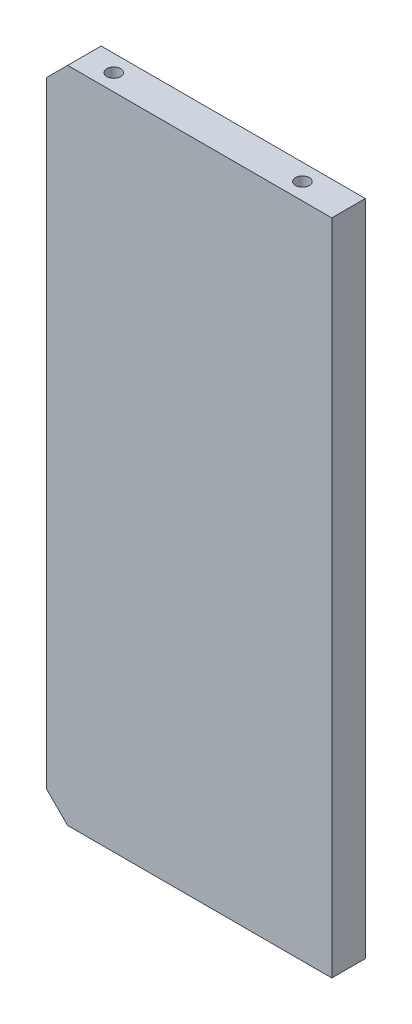
ISO-10303-21;
HEADER;
FILE_DESCRIPTION(('STEP AP214'),'2;1');
FILE_NAME('part.step','',(''),(''),'','','');
FILE_SCHEMA(('AUTOMOTIVE_DESIGN { 1 0 10303 214 1 1 1 1 }'));
ENDSEC;
DATA;
#1=APPLICATION_CONTEXT('core data for automotive mechanical design processes');
#2=APPLICATION_PROTOCOL_DEFINITION('international standard','automotive_design',2000,#1);
#3=PRODUCT_CONTEXT('',#1,'mechanical');
#4=PRODUCT('Part','Part','',(#3));
#5=PRODUCT_RELATED_PRODUCT_CATEGORY('part','',(#4));
#6=PRODUCT_DEFINITION_FORMATION('','',#4);
#7=PRODUCT_DEFINITION_CONTEXT('part definition',#1,'design');
#8=PRODUCT_DEFINITION('design','',#6,#7);
#9=PRODUCT_DEFINITION_SHAPE('','',#8);
#10=(LENGTH_UNIT() NAMED_UNIT(*) SI_UNIT(.MILLI.,.METRE.));
#11=(NAMED_UNIT(*) PLANE_ANGLE_UNIT() SI_UNIT($,.RADIAN.));
#12=(NAMED_UNIT(*) SI_UNIT($,.STERADIAN.) SOLID_ANGLE_UNIT());
#13=UNCERTAINTY_MEASURE_WITH_UNIT(LENGTH_MEASURE(1.E-05),#10,'distance_accuracy_value','');
#14=(GEOMETRIC_REPRESENTATION_CONTEXT(3) GLOBAL_UNCERTAINTY_ASSIGNED_CONTEXT((#13)) GLOBAL_UNIT_ASSIGNED_CONTEXT((#10,
#11,#12)) REPRESENTATION_CONTEXT('',''));
#15=CARTESIAN_POINT('',(0.,0.,0.));
#16=DIRECTION('',(0.,0.,1.));
#17=DIRECTION('',(1.,0.,0.));
#18=AXIS2_PLACEMENT_3D('',#15,#16,#17);
#19=CARTESIAN_POINT('',(68.,-78.5,-8.));
#20=DIRECTION('',(1.,0.,0.));
#21=DIRECTION('',(0.,0.,-1.));
#22=AXIS2_PLACEMENT_3D('',#19,#20,#21);
#23=PLANE('',#22);
#24=DIRECTION('',(0.,1.,0.));
#25=VECTOR('',#24,1.);
#26=CARTESIAN_POINT('',(68.,-78.5,0.));
#27=LINE('',#26,#25);
#28=CARTESIAN_POINT('',(68.,-78.5,0.));
#29=VERTEX_POINT('',#28);
#30=CARTESIAN_POINT('',(68.,78.5,0.));
#31=VERTEX_POINT('',#30);
#32=EDGE_CURVE('E165',#29,#31,#27,.T.);
#33=ORIENTED_EDGE('',*,*,#32,.F.);
#34=DIRECTION('',(0.,0.,1.));
#35=VECTOR('',#34,1.);
#36=CARTESIAN_POINT('',(68.,-78.5,-8.));
#37=LINE('',#36,#35);
#38=CARTESIAN_POINT('',(68.,-78.5,-8.));
#39=VERTEX_POINT('',#38);
#40=EDGE_CURVE('E188',#39,#29,#37,.T.);
#41=ORIENTED_EDGE('',*,*,#40,.F.);
#42=DIRECTION('',(0.,1.,0.));
#43=VECTOR('',#42,1.);
#44=CARTESIAN_POINT('',(68.,-78.5,-8.));
#45=LINE('',#44,#43);
#46=CARTESIAN_POINT('',(68.,78.5,-8.));
#47=VERTEX_POINT('',#46);
#48=EDGE_CURVE('E166',#39,#47,#45,.T.);
#49=ORIENTED_EDGE('',*,*,#48,.T.);
#50=DIRECTION('',(0.,0.,1.));
#51=VECTOR('',#50,1.);
#52=CARTESIAN_POINT('',(68.,78.5,-8.));
#53=LINE('',#52,#51);
#54=EDGE_CURVE('E177',#47,#31,#53,.T.);
#55=ORIENTED_EDGE('',*,*,#54,.T.);
#56=EDGE_LOOP('',(#33,#41,#49,#55));
#57=FACE_BOUND('',#56,.T.);
#58=ADVANCED_FACE('F38',(#57),#23,.T.);
#59=CARTESIAN_POINT('',(68.,-78.5,-8.));
#60=DIRECTION('',(0.,-1.,0.));
#61=DIRECTION('',(1.,0.,0.));
#62=AXIS2_PLACEMENT_3D('',#59,#60,#61);
#63=PLANE('',#62);
#64=CARTESIAN_POINT('',(12.,-78.5,-4.));
#65=DIRECTION('',(0.,-1.,0.));
#66=DIRECTION('',(0.,0.,-1.));
#67=AXIS2_PLACEMENT_3D('',#64,#65,#66);
#68=CIRCLE('',#67,1.65);
#69=CARTESIAN_POINT('',(12.,-78.5,-5.65));
#70=VERTEX_POINT('',#69);
#71=EDGE_CURVE('E124',#70,#70,#68,.T.);
#72=ORIENTED_EDGE('',*,*,#71,.F.);
#73=EDGE_LOOP('',(#72));
#74=FACE_BOUND('',#73,.T.);
#75=CARTESIAN_POINT('',(57.,-78.5,-4.));
#76=DIRECTION('',(0.,-1.,0.));
#77=DIRECTION('',(0.,0.,-1.));
#78=AXIS2_PLACEMENT_3D('',#75,#76,#77);
#79=CIRCLE('',#78,1.65);
#80=CARTESIAN_POINT('',(57.,-78.5,-5.65));
#81=VERTEX_POINT('',#80);
#82=EDGE_CURVE('E123',#81,#81,#79,.T.);
#83=ORIENTED_EDGE('',*,*,#82,.F.);
#84=EDGE_LOOP('',(#83));
#85=FACE_BOUND('',#84,.T.);
#86=DIRECTION('',(1.,0.,0.));
#87=VECTOR('',#86,1.);
#88=CARTESIAN_POINT('',(68.,-78.5,0.));
#89=LINE('',#88,#87);
#90=CARTESIAN_POINT('',(5.00000000000002,-78.5,0.));
#91=VERTEX_POINT('',#90);
#92=EDGE_CURVE('E170',#91,#29,#89,.T.);
#93=ORIENTED_EDGE('',*,*,#92,.F.);
#94=DIRECTION('',(0.,0.,-1.));
#95=VECTOR('',#94,1.);
#96=CARTESIAN_POINT('',(5.00000000000002,-78.5,-8.));
#97=LINE('',#96,#95);
#98=CARTESIAN_POINT('',(5.00000000000003,-78.5,-8.));
#99=VERTEX_POINT('',#98);
#100=EDGE_CURVE('E61',#91,#99,#97,.T.);
#101=ORIENTED_EDGE('',*,*,#100,.T.);
#102=DIRECTION('',(1.,0.,0.));
#103=VECTOR('',#102,1.);
#104=CARTESIAN_POINT('',(68.,-78.5,-8.));
#105=LINE('',#104,#103);
#106=EDGE_CURVE('E175',#99,#39,#105,.T.);
#107=ORIENTED_EDGE('',*,*,#106,.T.);
#108=ORIENTED_EDGE('',*,*,#40,.T.);
#109=EDGE_LOOP('',(#93,#101,#107,#108));
#110=FACE_BOUND('',#109,.T.);
#111=ADVANCED_FACE('F216',(#74,#85,#110),#63,.T.);
#112=CARTESIAN_POINT('',(0.,-78.5,-8.));
#113=DIRECTION('',(-1.,0.,0.));
#114=DIRECTION('',(0.,0.,1.));
#115=AXIS2_PLACEMENT_3D('',#112,#113,#114);
#116=PLANE('',#115);
#117=CARTESIAN_POINT('',(0.,58.5,-4.));
#118=DIRECTION('',(-1.,0.,0.));
#119=DIRECTION('',(0.,0.,1.));
#120=AXIS2_PLACEMENT_3D('',#117,#118,#119);
#121=CIRCLE('',#120,1.65);
#122=CARTESIAN_POINT('',(0.,58.5,-2.35));
#123=VERTEX_POINT('',#122);
#124=EDGE_CURVE('E134',#123,#123,#121,.T.);
#125=ORIENTED_EDGE('',*,*,#124,.F.);
#126=EDGE_LOOP('',(#125));
#127=FACE_BOUND('',#126,.T.);
#128=CARTESIAN_POINT('',(0.,0.,-4.));
#129=DIRECTION('',(-1.,0.,0.));
#130=DIRECTION('',(0.,0.,1.));
#131=AXIS2_PLACEMENT_3D('',#128,#129,#130);
#132=CIRCLE('',#131,1.65);
#133=CARTESIAN_POINT('',(0.,0.,-2.35));
#134=VERTEX_POINT('',#133);
#135=EDGE_CURVE('E141',#134,#134,#132,.T.);
#136=ORIENTED_EDGE('',*,*,#135,.F.);
#137=EDGE_LOOP('',(#136));
#138=FACE_BOUND('',#137,.T.);
#139=CARTESIAN_POINT('',(0.,-58.5,-4.));
#140=DIRECTION('',(-1.,0.,0.));
#141=DIRECTION('',(0.,0.,1.));
#142=AXIS2_PLACEMENT_3D('',#139,#140,#141);
#143=CIRCLE('',#142,1.65);
#144=CARTESIAN_POINT('',(0.,-58.5,-2.35));
#145=VERTEX_POINT('',#144);
#146=EDGE_CURVE('E147',#145,#145,#143,.T.);
#147=ORIENTED_EDGE('',*,*,#146,.F.);
#148=EDGE_LOOP('',(#147));
#149=FACE_BOUND('',#148,.T.);
#150=DIRECTION('',(0.,-1.,0.));
#151=VECTOR('',#150,1.);
#152=CARTESIAN_POINT('',(0.,-78.5,-8.));
#153=LINE('',#152,#151);
#154=CARTESIAN_POINT('',(0.,73.5,-8.));
#155=VERTEX_POINT('',#154);
#156=CARTESIAN_POINT('',(0.,-73.5,-8.));
#157=VERTEX_POINT('',#156);
#158=EDGE_CURVE('E172',#155,#157,#153,.T.);
#159=ORIENTED_EDGE('',*,*,#158,.T.);
#160=DIRECTION('',(0.,0.,1.));
#161=VECTOR('',#160,1.);
#162=CARTESIAN_POINT('',(0.,-73.5,-8.));
#163=LINE('',#162,#161);
#164=CARTESIAN_POINT('',(0.,-73.5,0.));
#165=VERTEX_POINT('',#164);
#166=EDGE_CURVE('E194',#157,#165,#163,.T.);
#167=ORIENTED_EDGE('',*,*,#166,.T.);
#168=DIRECTION('',(0.,-1.,0.));
#169=VECTOR('',#168,1.);
#170=CARTESIAN_POINT('',(0.,-78.5,0.));
#171=LINE('',#170,#169);
#172=CARTESIAN_POINT('',(0.,73.4999999999999,0.));
#173=VERTEX_POINT('',#172);
#174=EDGE_CURVE('E184',#173,#165,#171,.T.);
#175=ORIENTED_EDGE('',*,*,#174,.F.);
#176=DIRECTION('',(0.,0.,-1.));
#177=VECTOR('',#176,1.);
#178=CARTESIAN_POINT('',(0.,73.4999999999999,-8.));
#179=LINE('',#178,#177);
#180=EDGE_CURVE('E191',#173,#155,#179,.T.);
#181=ORIENTED_EDGE('',*,*,#180,.T.);
#182=EDGE_LOOP('',(#159,#167,#175,#181));
#183=FACE_BOUND('',#182,.T.);
#184=ADVANCED_FACE('F210',(#127,#138,#149,#183),#116,.T.);
#185=CARTESIAN_POINT('',(68.,78.5,-8.));
#186=DIRECTION('',(0.,1.,0.));
#187=DIRECTION('',(-1.,0.,0.));
#188=AXIS2_PLACEMENT_3D('',#185,#186,#187);
#189=PLANE('',#188);
#190=CARTESIAN_POINT('',(12.,78.5,-4.));
#191=DIRECTION('',(0.,1.,0.));
#192=DIRECTION('',(0.,0.,1.));
#193=AXIS2_PLACEMENT_3D('',#190,#191,#192);
#194=CIRCLE('',#193,1.65);
#195=CARTESIAN_POINT('',(12.,78.5,-2.35));
#196=VERTEX_POINT('',#195);
#197=EDGE_CURVE('E153',#196,#196,#194,.T.);
#198=ORIENTED_EDGE('',*,*,#197,.F.);
#199=EDGE_LOOP('',(#198));
#200=FACE_BOUND('',#199,.T.);
#201=CARTESIAN_POINT('',(57.,78.5,-4.));
#202=DIRECTION('',(0.,1.,0.));
#203=DIRECTION('',(0.,0.,1.));
#204=AXIS2_PLACEMENT_3D('',#201,#202,#203);
#205=CIRCLE('',#204,1.65);
#206=CARTESIAN_POINT('',(57.,78.5,-2.35));
#207=VERTEX_POINT('',#206);
#208=EDGE_CURVE('E159',#207,#207,#205,.T.);
#209=ORIENTED_EDGE('',*,*,#208,.F.);
#210=EDGE_LOOP('',(#209));
#211=FACE_BOUND('',#210,.T.);
#212=DIRECTION('',(-1.,0.,0.));
#213=VECTOR('',#212,1.);
#214=CARTESIAN_POINT('',(68.,78.5,-8.));
#215=LINE('',#214,#213);
#216=CARTESIAN_POINT('',(5.00000000000002,78.5,-8.));
#217=VERTEX_POINT('',#216);
#218=EDGE_CURVE('E169',#47,#217,#215,.T.);
#219=ORIENTED_EDGE('',*,*,#218,.T.);
#220=DIRECTION('',(0.,0.,1.));
#221=VECTOR('',#220,1.);
#222=CARTESIAN_POINT('',(5.00000000000002,78.5,-8.));
#223=LINE('',#222,#221);
#224=CARTESIAN_POINT('',(5.00000000000002,78.5,0.));
#225=VERTEX_POINT('',#224);
#226=EDGE_CURVE('E11',#217,#225,#223,.T.);
#227=ORIENTED_EDGE('',*,*,#226,.T.);
#228=DIRECTION('',(-1.,0.,0.));
#229=VECTOR('',#228,1.);
#230=CARTESIAN_POINT('',(68.,78.5,0.));
#231=LINE('',#230,#229);
#232=EDGE_CURVE('E181',#31,#225,#231,.T.);
#233=ORIENTED_EDGE('',*,*,#232,.F.);
#234=ORIENTED_EDGE('',*,*,#54,.F.);
#235=EDGE_LOOP('',(#219,#227,#233,#234));
#236=FACE_BOUND('',#235,.T.);
#237=ADVANCED_FACE('F222',(#200,#211,#236),#189,.T.);
#238=CARTESIAN_POINT('',(68.,78.5,-8.));
#239=DIRECTION('',(0.,0.,1.));
#240=DIRECTION('',(1.,0.,0.));
#241=AXIS2_PLACEMENT_3D('',#238,#239,#240);
#242=PLANE('',#241);
#243=ORIENTED_EDGE('',*,*,#106,.F.);
#244=DIRECTION('',(0.707106781186549,-0.707106781186547,0.));
#245=VECTOR('',#244,1.);
#246=CARTESIAN_POINT('',(0.,-73.5,-8.));
#247=LINE('',#246,#245);
#248=EDGE_CURVE('E46',#99,#157,#247,.F.);
#249=ORIENTED_EDGE('',*,*,#248,.T.);
#250=ORIENTED_EDGE('',*,*,#158,.F.);
#251=DIRECTION('',(-0.707106781186545,-0.70710678118655,0.));
#252=VECTOR('',#251,1.);
#253=CARTESIAN_POINT('',(5.00000000000002,78.5,-8.));
#254=LINE('',#253,#252);
#255=EDGE_CURVE('E53',#155,#217,#254,.F.);
#256=ORIENTED_EDGE('',*,*,#255,.T.);
#257=ORIENTED_EDGE('',*,*,#218,.F.);
#258=ORIENTED_EDGE('',*,*,#48,.F.);
#259=EDGE_LOOP('',(#243,#249,#250,#256,#257,#258));
#260=FACE_BOUND('',#259,.T.);
#261=ADVANCED_FACE('F205',(#260),#242,.F.);
#262=CARTESIAN_POINT('',(68.,78.5,0.));
#263=DIRECTION('',(0.,0.,1.));
#264=DIRECTION('',(1.,0.,0.));
#265=AXIS2_PLACEMENT_3D('',#262,#263,#264);
#266=PLANE('',#265);
#267=ORIENTED_EDGE('',*,*,#174,.T.);
#268=DIRECTION('',(-0.707106781186549,0.707106781186547,0.));
#269=VECTOR('',#268,1.);
#270=CARTESIAN_POINT('',(-41.9999999999999,-31.5000000000002,0.));
#271=LINE('',#270,#269);
#272=EDGE_CURVE('E199',#165,#91,#271,.F.);
#273=ORIENTED_EDGE('',*,*,#272,.T.);
#274=ORIENTED_EDGE('',*,*,#92,.T.);
#275=ORIENTED_EDGE('',*,*,#32,.T.);
#276=ORIENTED_EDGE('',*,*,#232,.T.);
#277=DIRECTION('',(0.707106781186545,0.70710678118655,0.));
#278=VECTOR('',#277,1.);
#279=CARTESIAN_POINT('',(36.4999999999998,110.,0.));
#280=LINE('',#279,#278);
#281=EDGE_CURVE('E197',#225,#173,#280,.F.);
#282=ORIENTED_EDGE('',*,*,#281,.T.);
#283=EDGE_LOOP('',(#267,#273,#274,#275,#276,#282));
#284=FACE_BOUND('',#283,.T.);
#285=ADVANCED_FACE('F215',(#284),#266,.T.);
#286=CARTESIAN_POINT('',(57.,62.4,-4.));
#287=DIRECTION('',(0.,1.,0.));
#288=DIRECTION('',(0.,0.,1.));
#289=AXIS2_PLACEMENT_3D('',#286,#287,#288);
#290=CONICAL_SURFACE('',#289,1.65,1.02974425867665);
#291=CARTESIAN_POINT('',(57.,61.4085799786045,-4.));
#292=VERTEX_POINT('',#291);
#293=VERTEX_LOOP('',#292);
#294=FACE_BOUND('',#293,.T.);
#295=CARTESIAN_POINT('',(57.,62.4,-4.));
#296=DIRECTION('',(0.,1.,0.));
#297=DIRECTION('',(0.,0.,1.));
#298=AXIS2_PLACEMENT_3D('',#295,#296,#297);
#299=CIRCLE('',#298,1.65);
#300=CARTESIAN_POINT('',(57.,62.4,-2.35));
#301=VERTEX_POINT('',#300);
#302=EDGE_CURVE('E162',#301,#301,#299,.T.);
#303=ORIENTED_EDGE('',*,*,#302,.T.);
#304=EDGE_LOOP('',(#303));
#305=FACE_BOUND('',#304,.T.);
#306=ADVANCED_FACE('F245',(#294,#305),#290,.F.);
#307=CARTESIAN_POINT('',(57.,78.5,-4.));
#308=DIRECTION('',(0.,1.,0.));
#309=DIRECTION('',(0.,0.,1.));
#310=AXIS2_PLACEMENT_3D('',#307,#308,#309);
#311=CYLINDRICAL_SURFACE('',#310,1.65);
#312=ORIENTED_EDGE('',*,*,#302,.F.);
#313=EDGE_LOOP('',(#312));
#314=FACE_BOUND('',#313,.T.);
#315=ORIENTED_EDGE('',*,*,#208,.T.);
#316=EDGE_LOOP('',(#315));
#317=FACE_BOUND('',#316,.T.);
#318=ADVANCED_FACE('F250',(#314,#317),#311,.F.);
#319=CARTESIAN_POINT('',(12.,62.4,-4.));
#320=DIRECTION('',(0.,1.,0.));
#321=DIRECTION('',(0.,0.,1.));
#322=AXIS2_PLACEMENT_3D('',#319,#320,#321);
#323=CONICAL_SURFACE('',#322,1.65,1.02974425867665);
#324=CARTESIAN_POINT('',(12.,61.4085799786045,-4.));
#325=VERTEX_POINT('',#324);
#326=VERTEX_LOOP('',#325);
#327=FACE_BOUND('',#326,.T.);
#328=CARTESIAN_POINT('',(12.,62.4,-4.));
#329=DIRECTION('',(0.,1.,0.));
#330=DIRECTION('',(0.,0.,1.));
#331=AXIS2_PLACEMENT_3D('',#328,#329,#330);
#332=CIRCLE('',#331,1.65);
#333=CARTESIAN_POINT('',(12.,62.4,-2.35));
#334=VERTEX_POINT('',#333);
#335=EDGE_CURVE('E156',#334,#334,#332,.T.);
#336=ORIENTED_EDGE('',*,*,#335,.T.);
#337=EDGE_LOOP('',(#336));
#338=FACE_BOUND('',#337,.T.);
#339=ADVANCED_FACE('F254',(#327,#338),#323,.F.);
#340=CARTESIAN_POINT('',(12.,78.5,-4.));
#341=DIRECTION('',(0.,1.,0.));
#342=DIRECTION('',(0.,0.,1.));
#343=AXIS2_PLACEMENT_3D('',#340,#341,#342);
#344=CYLINDRICAL_SURFACE('',#343,1.65);
#345=ORIENTED_EDGE('',*,*,#335,.F.);
#346=EDGE_LOOP('',(#345));
#347=FACE_BOUND('',#346,.T.);
#348=ORIENTED_EDGE('',*,*,#197,.T.);
#349=EDGE_LOOP('',(#348));
#350=FACE_BOUND('',#349,.T.);
#351=ADVANCED_FACE('F258',(#347,#350),#344,.F.);
#352=CARTESIAN_POINT('',(10.1,-58.5,-4.));
#353=DIRECTION('',(-1.,0.,0.));
#354=DIRECTION('',(0.,0.,1.));
#355=AXIS2_PLACEMENT_3D('',#352,#353,#354);
#356=CONICAL_SURFACE('',#355,1.65,1.02974425867665);
#357=CARTESIAN_POINT('',(11.0914200213955,-58.5,-4.));
#358=VERTEX_POINT('',#357);
#359=VERTEX_LOOP('',#358);
#360=FACE_BOUND('',#359,.T.);
#361=CARTESIAN_POINT('',(10.1,-58.5,-4.));
#362=DIRECTION('',(-1.,0.,0.));
#363=DIRECTION('',(0.,0.,1.));
#364=AXIS2_PLACEMENT_3D('',#361,#362,#363);
#365=CIRCLE('',#364,1.65);
#366=CARTESIAN_POINT('',(10.1,-58.5,-2.35));
#367=VERTEX_POINT('',#366);
#368=EDGE_CURVE('E150',#367,#367,#365,.T.);
#369=ORIENTED_EDGE('',*,*,#368,.T.);
#370=EDGE_LOOP('',(#369));
#371=FACE_BOUND('',#370,.T.);
#372=ADVANCED_FACE('F262',(#360,#371),#356,.F.);
#373=CARTESIAN_POINT('',(0.,-58.5,-4.));
#374=DIRECTION('',(-1.,0.,0.));
#375=DIRECTION('',(0.,0.,1.));
#376=AXIS2_PLACEMENT_3D('',#373,#374,#375);
#377=CYLINDRICAL_SURFACE('',#376,1.65);
#378=ORIENTED_EDGE('',*,*,#368,.F.);
#379=EDGE_LOOP('',(#378));
#380=FACE_BOUND('',#379,.T.);
#381=ORIENTED_EDGE('',*,*,#146,.T.);
#382=EDGE_LOOP('',(#381));
#383=FACE_BOUND('',#382,.T.);
#384=ADVANCED_FACE('F266',(#380,#383),#377,.F.);
#385=CARTESIAN_POINT('',(10.1,0.,-4.));
#386=DIRECTION('',(-1.,0.,0.));
#387=DIRECTION('',(0.,0.,1.));
#388=AXIS2_PLACEMENT_3D('',#385,#386,#387);
#389=CONICAL_SURFACE('',#388,1.65,1.02974425867665);
#390=CARTESIAN_POINT('',(11.0914200213955,0.,-4.));
#391=VERTEX_POINT('',#390);
#392=VERTEX_LOOP('',#391);
#393=FACE_BOUND('',#392,.T.);
#394=CARTESIAN_POINT('',(10.1,0.,-4.));
#395=DIRECTION('',(-1.,0.,0.));
#396=DIRECTION('',(0.,0.,1.));
#397=AXIS2_PLACEMENT_3D('',#394,#395,#396);
#398=CIRCLE('',#397,1.65);
#399=CARTESIAN_POINT('',(10.1,0.,-2.35));
#400=VERTEX_POINT('',#399);
#401=EDGE_CURVE('E144',#400,#400,#398,.T.);
#402=ORIENTED_EDGE('',*,*,#401,.T.);
#403=EDGE_LOOP('',(#402));
#404=FACE_BOUND('',#403,.T.);
#405=ADVANCED_FACE('F270',(#393,#404),#389,.F.);
#406=CARTESIAN_POINT('',(0.,0.,-4.));
#407=DIRECTION('',(-1.,0.,0.));
#408=DIRECTION('',(0.,0.,1.));
#409=AXIS2_PLACEMENT_3D('',#406,#407,#408);
#410=CYLINDRICAL_SURFACE('',#409,1.65);
#411=ORIENTED_EDGE('',*,*,#401,.F.);
#412=EDGE_LOOP('',(#411));
#413=FACE_BOUND('',#412,.T.);
#414=ORIENTED_EDGE('',*,*,#135,.T.);
#415=EDGE_LOOP('',(#414));
#416=FACE_BOUND('',#415,.T.);
#417=ADVANCED_FACE('F274',(#413,#416),#410,.F.);
#418=CARTESIAN_POINT('',(10.1,58.5,-4.));
#419=DIRECTION('',(-1.,0.,0.));
#420=DIRECTION('',(0.,0.,1.));
#421=AXIS2_PLACEMENT_3D('',#418,#419,#420);
#422=CONICAL_SURFACE('',#421,1.65,1.02974425867665);
#423=CARTESIAN_POINT('',(11.0914200213955,58.5,-4.));
#424=VERTEX_POINT('',#423);
#425=VERTEX_LOOP('',#424);
#426=FACE_BOUND('',#425,.T.);
#427=CARTESIAN_POINT('',(10.1,58.5,-4.));
#428=DIRECTION('',(-1.,0.,0.));
#429=DIRECTION('',(0.,0.,1.));
#430=AXIS2_PLACEMENT_3D('',#427,#428,#429);
#431=CIRCLE('',#430,1.65);
#432=CARTESIAN_POINT('',(10.1,58.5,-2.35));
#433=VERTEX_POINT('',#432);
#434=EDGE_CURVE('E138',#433,#433,#431,.T.);
#435=ORIENTED_EDGE('',*,*,#434,.T.);
#436=EDGE_LOOP('',(#435));
#437=FACE_BOUND('',#436,.T.);
#438=ADVANCED_FACE('F278',(#426,#437),#422,.F.);
#439=CARTESIAN_POINT('',(0.,58.5,-4.));
#440=DIRECTION('',(-1.,0.,0.));
#441=DIRECTION('',(0.,0.,1.));
#442=AXIS2_PLACEMENT_3D('',#439,#440,#441);
#443=CYLINDRICAL_SURFACE('',#442,1.65);
#444=ORIENTED_EDGE('',*,*,#434,.F.);
#445=EDGE_LOOP('',(#444));
#446=FACE_BOUND('',#445,.T.);
#447=ORIENTED_EDGE('',*,*,#124,.T.);
#448=EDGE_LOOP('',(#447));
#449=FACE_BOUND('',#448,.T.);
#450=ADVANCED_FACE('F282',(#446,#449),#443,.F.);
#451=CARTESIAN_POINT('',(57.,-62.4,-4.));
#452=DIRECTION('',(0.,-1.,0.));
#453=DIRECTION('',(0.,0.,-1.));
#454=AXIS2_PLACEMENT_3D('',#451,#452,#453);
#455=CONICAL_SURFACE('',#454,1.65,1.02974425867665);
#456=CARTESIAN_POINT('',(57.,-61.4085799786045,-4.));
#457=VERTEX_POINT('',#456);
#458=VERTEX_LOOP('',#457);
#459=FACE_BOUND('',#458,.T.);
#460=CARTESIAN_POINT('',(57.,-62.4,-4.));
#461=DIRECTION('',(0.,-1.,0.));
#462=DIRECTION('',(0.,0.,-1.));
#463=AXIS2_PLACEMENT_3D('',#460,#461,#462);
#464=CIRCLE('',#463,1.65);
#465=CARTESIAN_POINT('',(57.,-62.4,-5.65));
#466=VERTEX_POINT('',#465);
#467=EDGE_CURVE('E127',#466,#466,#464,.T.);
#468=ORIENTED_EDGE('',*,*,#467,.T.);
#469=EDGE_LOOP('',(#468));
#470=FACE_BOUND('',#469,.T.);
#471=ADVANCED_FACE('F286',(#459,#470),#455,.F.);
#472=CARTESIAN_POINT('',(57.,-78.5,-4.));
#473=DIRECTION('',(0.,-1.,0.));
#474=DIRECTION('',(0.,0.,-1.));
#475=AXIS2_PLACEMENT_3D('',#472,#473,#474);
#476=CYLINDRICAL_SURFACE('',#475,1.65);
#477=ORIENTED_EDGE('',*,*,#467,.F.);
#478=EDGE_LOOP('',(#477));
#479=FACE_BOUND('',#478,.T.);
#480=ORIENTED_EDGE('',*,*,#82,.T.);
#481=EDGE_LOOP('',(#480));
#482=FACE_BOUND('',#481,.T.);
#483=ADVANCED_FACE('F117',(#479,#482),#476,.F.);
#484=CARTESIAN_POINT('',(12.,-62.4,-4.));
#485=DIRECTION('',(0.,-1.,0.));
#486=DIRECTION('',(0.,0.,-1.));
#487=AXIS2_PLACEMENT_3D('',#484,#485,#486);
#488=CONICAL_SURFACE('',#487,1.65,1.02974425867665);
#489=CARTESIAN_POINT('',(12.,-61.4085799786045,-4.));
#490=VERTEX_POINT('',#489);
#491=VERTEX_LOOP('',#490);
#492=FACE_BOUND('',#491,.T.);
#493=CARTESIAN_POINT('',(12.,-62.4,-4.));
#494=DIRECTION('',(0.,-1.,0.));
#495=DIRECTION('',(0.,0.,-1.));
#496=AXIS2_PLACEMENT_3D('',#493,#494,#495);
#497=CIRCLE('',#496,1.65);
#498=CARTESIAN_POINT('',(12.,-62.4,-5.65));
#499=VERTEX_POINT('',#498);
#500=EDGE_CURVE('E121',#499,#499,#497,.T.);
#501=ORIENTED_EDGE('',*,*,#500,.T.);
#502=EDGE_LOOP('',(#501));
#503=FACE_BOUND('',#502,.T.);
#504=ADVANCED_FACE('F113',(#492,#503),#488,.F.);
#505=CARTESIAN_POINT('',(12.,-78.5,-4.));
#506=DIRECTION('',(0.,-1.,0.));
#507=DIRECTION('',(0.,0.,-1.));
#508=AXIS2_PLACEMENT_3D('',#505,#506,#507);
#509=CYLINDRICAL_SURFACE('',#508,1.65);
#510=ORIENTED_EDGE('',*,*,#500,.F.);
#511=EDGE_LOOP('',(#510));
#512=FACE_BOUND('',#511,.T.);
#513=ORIENTED_EDGE('',*,*,#71,.T.);
#514=EDGE_LOOP('',(#513));
#515=FACE_BOUND('',#514,.T.);
#516=ADVANCED_FACE('F116',(#512,#515),#509,.F.);
#517=CARTESIAN_POINT('',(0.,-73.5,-8.));
#518=DIRECTION('',(0.707106781186547,0.707106781186549,0.));
#519=DIRECTION('',(-0.707106781186549,0.707106781186547,0.));
#520=AXIS2_PLACEMENT_3D('',#517,#518,#519);
#521=PLANE('',#520);
#522=ORIENTED_EDGE('',*,*,#248,.F.);
#523=ORIENTED_EDGE('',*,*,#100,.F.);
#524=ORIENTED_EDGE('',*,*,#272,.F.);
#525=ORIENTED_EDGE('',*,*,#166,.F.);
#526=EDGE_LOOP('',(#522,#523,#524,#525));
#527=FACE_BOUND('',#526,.T.);
#528=ADVANCED_FACE('F213',(#527),#521,.F.);
#529=CARTESIAN_POINT('',(5.00000000000002,78.5,-8.));
#530=DIRECTION('',(0.70710678118655,-0.707106781186545,0.));
#531=DIRECTION('',(0.707106781186545,0.70710678118655,0.));
#532=AXIS2_PLACEMENT_3D('',#529,#530,#531);
#533=PLANE('',#532);
#534=ORIENTED_EDGE('',*,*,#255,.F.);
#535=ORIENTED_EDGE('',*,*,#180,.F.);
#536=ORIENTED_EDGE('',*,*,#281,.F.);
#537=ORIENTED_EDGE('',*,*,#226,.F.);
#538=EDGE_LOOP('',(#534,#535,#536,#537));
#539=FACE_BOUND('',#538,.T.);
#540=ADVANCED_FACE('F40',(#539),#533,.F.);
#541=CLOSED_SHELL('',(#58,#111,#184,#237,#261,#285,#306,#318,#339,#351,#372,#384,#405,#417,#438,
#450,#471,#483,#504,#516,#528,#540));
#542=MANIFOLD_SOLID_BREP('B2',#541);
#543=ADVANCED_BREP_SHAPE_REPRESENTATION('',(#18,#542),#14);
#544=SHAPE_DEFINITION_REPRESENTATION(#9,#543);
ENDSEC;
END-ISO-10303-21;
